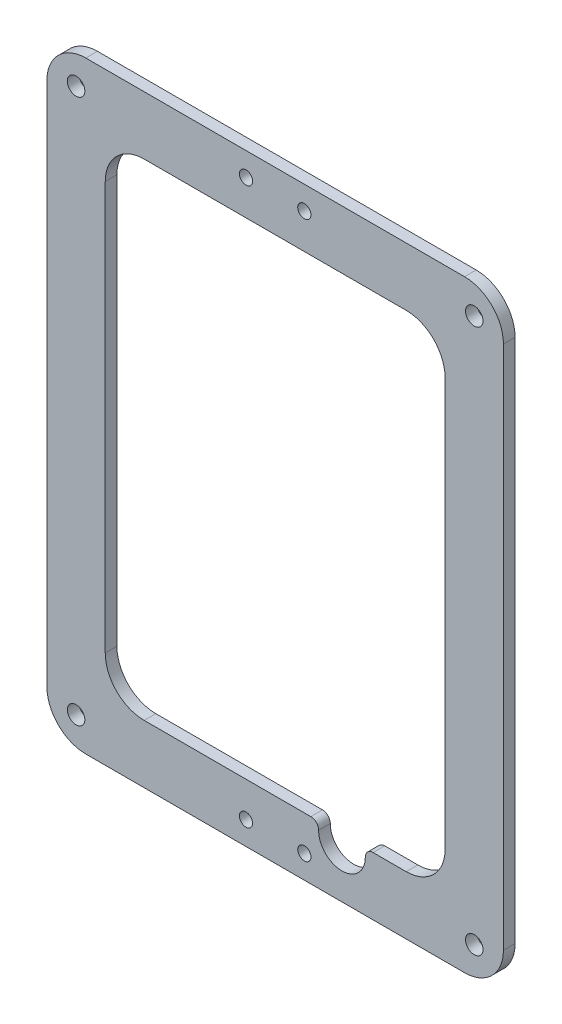
ISO-10303-21;
HEADER;
FILE_DESCRIPTION(('STEP AP214'),'2;1');
FILE_NAME('part.step','',(''),(''),'','','');
FILE_SCHEMA(('AUTOMOTIVE_DESIGN { 1 0 10303 214 1 1 1 1 }'));
ENDSEC;
DATA;
#1=APPLICATION_CONTEXT('core data for automotive mechanical design processes');
#2=APPLICATION_PROTOCOL_DEFINITION('international standard','automotive_design',2000,#1);
#3=PRODUCT_CONTEXT('',#1,'mechanical');
#4=PRODUCT('Part','Part','',(#3));
#5=PRODUCT_RELATED_PRODUCT_CATEGORY('part','',(#4));
#6=PRODUCT_DEFINITION_FORMATION('','',#4);
#7=PRODUCT_DEFINITION_CONTEXT('part definition',#1,'design');
#8=PRODUCT_DEFINITION('design','',#6,#7);
#9=PRODUCT_DEFINITION_SHAPE('','',#8);
#10=(LENGTH_UNIT() NAMED_UNIT(*) SI_UNIT(.MILLI.,.METRE.));
#11=(NAMED_UNIT(*) PLANE_ANGLE_UNIT() SI_UNIT($,.RADIAN.));
#12=(NAMED_UNIT(*) SI_UNIT($,.STERADIAN.) SOLID_ANGLE_UNIT());
#13=UNCERTAINTY_MEASURE_WITH_UNIT(LENGTH_MEASURE(1.E-05),#10,'distance_accuracy_value','');
#14=(GEOMETRIC_REPRESENTATION_CONTEXT(3) GLOBAL_UNCERTAINTY_ASSIGNED_CONTEXT((#13)) GLOBAL_UNIT_ASSIGNED_CONTEXT((#10,
#11,#12)) REPRESENTATION_CONTEXT('',''));
#15=CARTESIAN_POINT('',(0.,0.,0.));
#16=DIRECTION('',(0.,0.,1.));
#17=DIRECTION('',(1.,0.,0.));
#18=AXIS2_PLACEMENT_3D('',#15,#16,#17);
#19=CARTESIAN_POINT('',(58.6964815263287,0.,103.));
#20=DIRECTION('',(-1.,0.,0.));
#21=DIRECTION('',(0.,-1.,0.));
#22=AXIS2_PLACEMENT_3D('',#19,#20,#21);
#23=PLANE('',#22);
#24=DIRECTION('',(0.,1.,0.));
#25=VECTOR('',#24,1.);
#26=CARTESIAN_POINT('',(58.6964815263287,0.,100.));
#27=LINE('',#26,#25);
#28=CARTESIAN_POINT('',(58.6964815263287,-145.,100.));
#29=VERTEX_POINT('',#28);
#30=CARTESIAN_POINT('',(58.6964815263287,-9.99999999999999,100.));
#31=VERTEX_POINT('',#30);
#32=EDGE_CURVE('E266',#29,#31,#27,.T.);
#33=ORIENTED_EDGE('',*,*,#32,.T.);
#34=DIRECTION('',(0.,0.,-1.));
#35=VECTOR('',#34,1.);
#36=CARTESIAN_POINT('',(58.6964815263287,-9.99999999999999,103.));
#37=LINE('',#36,#35);
#38=CARTESIAN_POINT('',(58.6964815263287,-9.99999999999999,103.));
#39=VERTEX_POINT('',#38);
#40=EDGE_CURVE('E303',#39,#31,#37,.T.);
#41=ORIENTED_EDGE('',*,*,#40,.F.);
#42=DIRECTION('',(0.,1.,0.));
#43=VECTOR('',#42,1.);
#44=CARTESIAN_POINT('',(58.6964815263287,0.,103.));
#45=LINE('',#44,#43);
#46=CARTESIAN_POINT('',(58.6964815263287,-145.,103.));
#47=VERTEX_POINT('',#46);
#48=EDGE_CURVE('E222',#47,#39,#45,.T.);
#49=ORIENTED_EDGE('',*,*,#48,.F.);
#50=DIRECTION('',(0.,0.,-1.));
#51=VECTOR('',#50,1.);
#52=CARTESIAN_POINT('',(58.6964815263287,-145.,103.));
#53=LINE('',#52,#51);
#54=EDGE_CURVE('E188',#47,#29,#53,.T.);
#55=ORIENTED_EDGE('',*,*,#54,.T.);
#56=EDGE_LOOP('',(#33,#41,#49,#55));
#57=FACE_BOUND('',#56,.T.);
#58=ADVANCED_FACE('F39',(#57),#23,.F.);
#59=CARTESIAN_POINT('',(48.6964815263286,-9.99999999999999,103.));
#60=DIRECTION('',(0.,0.,-1.));
#61=DIRECTION('',(-1.,0.,0.));
#62=AXIS2_PLACEMENT_3D('',#59,#60,#61);
#63=CYLINDRICAL_SURFACE('',#62,10.);
#64=CARTESIAN_POINT('',(48.6964815263286,-9.99999999999999,100.));
#65=DIRECTION('',(0.,0.,1.));
#66=DIRECTION('',(1.,0.,0.));
#67=AXIS2_PLACEMENT_3D('',#64,#65,#66);
#68=CIRCLE('',#67,10.);
#69=CARTESIAN_POINT('',(48.6964815263286,0.,100.));
#70=VERTEX_POINT('',#69);
#71=EDGE_CURVE('E269',#31,#70,#68,.T.);
#72=ORIENTED_EDGE('',*,*,#71,.T.);
#73=DIRECTION('',(0.,0.,-1.));
#74=VECTOR('',#73,1.);
#75=CARTESIAN_POINT('',(48.6964815263286,0.,103.));
#76=LINE('',#75,#74);
#77=CARTESIAN_POINT('',(48.6964815263286,0.,103.));
#78=VERTEX_POINT('',#77);
#79=EDGE_CURVE('E300',#78,#70,#76,.T.);
#80=ORIENTED_EDGE('',*,*,#79,.F.);
#81=CARTESIAN_POINT('',(48.6964815263286,-9.99999999999999,103.));
#82=DIRECTION('',(0.,0.,1.));
#83=DIRECTION('',(1.,0.,0.));
#84=AXIS2_PLACEMENT_3D('',#81,#82,#83);
#85=CIRCLE('',#84,10.);
#86=EDGE_CURVE('E225',#39,#78,#85,.T.);
#87=ORIENTED_EDGE('',*,*,#86,.F.);
#88=ORIENTED_EDGE('',*,*,#40,.T.);
#89=EDGE_LOOP('',(#72,#80,#87,#88));
#90=FACE_BOUND('',#89,.T.);
#91=ADVANCED_FACE('F377',(#90),#63,.T.);
#92=CARTESIAN_POINT('',(0.,0.,103.));
#93=DIRECTION('',(0.,-1.,0.));
#94=DIRECTION('',(1.,0.,0.));
#95=AXIS2_PLACEMENT_3D('',#92,#93,#94);
#96=PLANE('',#95);
#97=DIRECTION('',(-1.,0.,0.));
#98=VECTOR('',#97,1.);
#99=CARTESIAN_POINT('',(0.,0.,100.));
#100=LINE('',#99,#98);
#101=CARTESIAN_POINT('',(-48.6964815263286,0.,100.));
#102=VERTEX_POINT('',#101);
#103=EDGE_CURVE('E271',#70,#102,#100,.T.);
#104=ORIENTED_EDGE('',*,*,#103,.T.);
#105=DIRECTION('',(0.,0.,-1.));
#106=VECTOR('',#105,1.);
#107=CARTESIAN_POINT('',(-48.6964815263286,0.,103.));
#108=LINE('',#107,#106);
#109=CARTESIAN_POINT('',(-48.6964815263286,0.,103.));
#110=VERTEX_POINT('',#109);
#111=EDGE_CURVE('E297',#110,#102,#108,.T.);
#112=ORIENTED_EDGE('',*,*,#111,.F.);
#113=DIRECTION('',(-1.,0.,0.));
#114=VECTOR('',#113,1.);
#115=CARTESIAN_POINT('',(0.,0.,103.));
#116=LINE('',#115,#114);
#117=EDGE_CURVE('E227',#78,#110,#116,.T.);
#118=ORIENTED_EDGE('',*,*,#117,.F.);
#119=ORIENTED_EDGE('',*,*,#79,.T.);
#120=EDGE_LOOP('',(#104,#112,#118,#119));
#121=FACE_BOUND('',#120,.T.);
#122=ADVANCED_FACE('F383',(#121),#96,.F.);
#123=CARTESIAN_POINT('',(-48.6964815263286,-10.,103.));
#124=DIRECTION('',(0.,0.,-1.));
#125=DIRECTION('',(-1.,0.,0.));
#126=AXIS2_PLACEMENT_3D('',#123,#124,#125);
#127=CYLINDRICAL_SURFACE('',#126,9.99999999999999);
#128=CARTESIAN_POINT('',(-48.6964815263286,-10.,100.));
#129=DIRECTION('',(0.,0.,1.));
#130=DIRECTION('',(1.,0.,0.));
#131=AXIS2_PLACEMENT_3D('',#128,#129,#130);
#132=CIRCLE('',#131,9.99999999999999);
#133=CARTESIAN_POINT('',(-58.6964815263286,-10.,100.));
#134=VERTEX_POINT('',#133);
#135=EDGE_CURVE('E273',#102,#134,#132,.T.);
#136=ORIENTED_EDGE('',*,*,#135,.T.);
#137=DIRECTION('',(0.,0.,-1.));
#138=VECTOR('',#137,1.);
#139=CARTESIAN_POINT('',(-58.6964815263286,-10.,103.));
#140=LINE('',#139,#138);
#141=CARTESIAN_POINT('',(-58.6964815263286,-10.,103.));
#142=VERTEX_POINT('',#141);
#143=EDGE_CURVE('E294',#142,#134,#140,.T.);
#144=ORIENTED_EDGE('',*,*,#143,.F.);
#145=CARTESIAN_POINT('',(-48.6964815263286,-10.,103.));
#146=DIRECTION('',(0.,0.,1.));
#147=DIRECTION('',(1.,0.,0.));
#148=AXIS2_PLACEMENT_3D('',#145,#146,#147);
#149=CIRCLE('',#148,9.99999999999999);
#150=EDGE_CURVE('E229',#110,#142,#149,.T.);
#151=ORIENTED_EDGE('',*,*,#150,.F.);
#152=ORIENTED_EDGE('',*,*,#111,.T.);
#153=EDGE_LOOP('',(#136,#144,#151,#152));
#154=FACE_BOUND('',#153,.T.);
#155=ADVANCED_FACE('F425',(#154),#127,.T.);
#156=CARTESIAN_POINT('',(-58.6964815263286,0.,103.));
#157=DIRECTION('',(1.,0.,0.));
#158=DIRECTION('',(0.,1.,0.));
#159=AXIS2_PLACEMENT_3D('',#156,#157,#158);
#160=PLANE('',#159);
#161=DIRECTION('',(0.,-1.,0.));
#162=VECTOR('',#161,1.);
#163=CARTESIAN_POINT('',(-58.6964815263286,0.,100.));
#164=LINE('',#163,#162);
#165=CARTESIAN_POINT('',(-58.6964815263286,-145.,100.));
#166=VERTEX_POINT('',#165);
#167=EDGE_CURVE('E275',#134,#166,#164,.T.);
#168=ORIENTED_EDGE('',*,*,#167,.T.);
#169=DIRECTION('',(0.,0.,-1.));
#170=VECTOR('',#169,1.);
#171=CARTESIAN_POINT('',(-58.6964815263286,-145.,103.));
#172=LINE('',#171,#170);
#173=CARTESIAN_POINT('',(-58.6964815263286,-145.,103.));
#174=VERTEX_POINT('',#173);
#175=EDGE_CURVE('E291',#174,#166,#172,.T.);
#176=ORIENTED_EDGE('',*,*,#175,.F.);
#177=DIRECTION('',(0.,-1.,0.));
#178=VECTOR('',#177,1.);
#179=CARTESIAN_POINT('',(-58.6964815263286,0.,103.));
#180=LINE('',#179,#178);
#181=EDGE_CURVE('E231',#142,#174,#180,.T.);
#182=ORIENTED_EDGE('',*,*,#181,.F.);
#183=ORIENTED_EDGE('',*,*,#143,.T.);
#184=EDGE_LOOP('',(#168,#176,#182,#183));
#185=FACE_BOUND('',#184,.T.);
#186=ADVANCED_FACE('F417',(#185),#160,.F.);
#187=CARTESIAN_POINT('',(-48.6964815263286,-145.,103.));
#188=DIRECTION('',(0.,0.,-1.));
#189=DIRECTION('',(-1.,0.,0.));
#190=AXIS2_PLACEMENT_3D('',#187,#188,#189);
#191=CYLINDRICAL_SURFACE('',#190,9.99999999999998);
#192=CARTESIAN_POINT('',(-48.6964815263286,-145.,100.));
#193=DIRECTION('',(0.,0.,1.));
#194=DIRECTION('',(1.,0.,0.));
#195=AXIS2_PLACEMENT_3D('',#192,#193,#194);
#196=CIRCLE('',#195,9.99999999999998);
#197=CARTESIAN_POINT('',(-48.6964815263286,-155.,100.));
#198=VERTEX_POINT('',#197);
#199=EDGE_CURVE('E277',#166,#198,#196,.T.);
#200=ORIENTED_EDGE('',*,*,#199,.T.);
#201=DIRECTION('',(0.,0.,-1.));
#202=VECTOR('',#201,1.);
#203=CARTESIAN_POINT('',(-48.6964815263286,-155.,103.));
#204=LINE('',#203,#202);
#205=CARTESIAN_POINT('',(-48.6964815263286,-155.,103.));
#206=VERTEX_POINT('',#205);
#207=EDGE_CURVE('E288',#206,#198,#204,.T.);
#208=ORIENTED_EDGE('',*,*,#207,.F.);
#209=CARTESIAN_POINT('',(-48.6964815263286,-145.,103.));
#210=DIRECTION('',(0.,0.,1.));
#211=DIRECTION('',(1.,0.,0.));
#212=AXIS2_PLACEMENT_3D('',#209,#210,#211);
#213=CIRCLE('',#212,9.99999999999998);
#214=EDGE_CURVE('E233',#174,#206,#213,.T.);
#215=ORIENTED_EDGE('',*,*,#214,.F.);
#216=ORIENTED_EDGE('',*,*,#175,.T.);
#217=EDGE_LOOP('',(#200,#208,#215,#216));
#218=FACE_BOUND('',#217,.T.);
#219=ADVANCED_FACE('F411',(#218),#191,.T.);
#220=CARTESIAN_POINT('',(0.,-155.,103.));
#221=DIRECTION('',(0.,1.,0.));
#222=DIRECTION('',(0.,0.,1.));
#223=AXIS2_PLACEMENT_3D('',#220,#221,#222);
#224=PLANE('',#223);
#225=DIRECTION('',(1.,0.,0.));
#226=VECTOR('',#225,1.);
#227=CARTESIAN_POINT('',(0.,-155.,100.));
#228=LINE('',#227,#226);
#229=CARTESIAN_POINT('',(48.6964815263286,-155.,100.));
#230=VERTEX_POINT('',#229);
#231=EDGE_CURVE('E279',#198,#230,#228,.T.);
#232=ORIENTED_EDGE('',*,*,#231,.T.);
#233=DIRECTION('',(0.,0.,-1.));
#234=VECTOR('',#233,1.);
#235=CARTESIAN_POINT('',(48.6964815263286,-155.,103.));
#236=LINE('',#235,#234);
#237=CARTESIAN_POINT('',(48.6964815263286,-155.,103.));
#238=VERTEX_POINT('',#237);
#239=EDGE_CURVE('E285',#238,#230,#236,.T.);
#240=ORIENTED_EDGE('',*,*,#239,.F.);
#241=DIRECTION('',(1.,0.,0.));
#242=VECTOR('',#241,1.);
#243=CARTESIAN_POINT('',(0.,-155.,103.));
#244=LINE('',#243,#242);
#245=EDGE_CURVE('E235',#206,#238,#244,.T.);
#246=ORIENTED_EDGE('',*,*,#245,.F.);
#247=ORIENTED_EDGE('',*,*,#207,.T.);
#248=EDGE_LOOP('',(#232,#240,#246,#247));
#249=FACE_BOUND('',#248,.T.);
#250=ADVANCED_FACE('F406',(#249),#224,.F.);
#251=CARTESIAN_POINT('',(17.175,-142.094693275293,103.));
#252=DIRECTION('',(0.,0.,-1.));
#253=DIRECTION('',(-1.,0.,0.));
#254=AXIS2_PLACEMENT_3D('',#251,#252,#253);
#255=CYLINDRICAL_SURFACE('',#254,6.);
#256=CARTESIAN_POINT('',(17.175,-142.094693275293,100.));
#257=DIRECTION('',(0.,0.,1.));
#258=DIRECTION('',(1.,0.,0.));
#259=AXIS2_PLACEMENT_3D('',#256,#257,#258);
#260=CIRCLE('',#259,6.);
#261=CARTESIAN_POINT('',(11.1754203342415,-142.023673318823,100.));
#262=VERTEX_POINT('',#261);
#263=CARTESIAN_POINT('',(23.1745796657585,-142.023673318823,100.));
#264=VERTEX_POINT('',#263);
#265=EDGE_CURVE('E240',#262,#264,#260,.T.);
#266=ORIENTED_EDGE('',*,*,#265,.F.);
#267=DIRECTION('',(0.,0.,-1.));
#268=VECTOR('',#267,1.);
#269=CARTESIAN_POINT('',(11.1754203342415,-142.023673318823,103.));
#270=LINE('',#269,#268);
#271=CARTESIAN_POINT('',(11.1754203342415,-142.023673318823,103.));
#272=VERTEX_POINT('',#271);
#273=EDGE_CURVE('E328',#262,#272,#270,.F.);
#274=ORIENTED_EDGE('',*,*,#273,.T.);
#275=CARTESIAN_POINT('',(17.175,-142.094693275293,103.));
#276=DIRECTION('',(0.,0.,1.));
#277=DIRECTION('',(1.,0.,0.));
#278=AXIS2_PLACEMENT_3D('',#275,#276,#277);
#279=CIRCLE('',#278,6.);
#280=CARTESIAN_POINT('',(23.1745796657585,-142.023673318823,103.));
#281=VERTEX_POINT('',#280);
#282=EDGE_CURVE('E198',#272,#281,#279,.T.);
#283=ORIENTED_EDGE('',*,*,#282,.T.);
#284=DIRECTION('',(0.,0.,-1.));
#285=VECTOR('',#284,1.);
#286=CARTESIAN_POINT('',(23.1745796657585,-142.023673318823,103.));
#287=LINE('',#286,#285);
#288=EDGE_CURVE('E325',#281,#264,#287,.T.);
#289=ORIENTED_EDGE('',*,*,#288,.T.);
#290=EDGE_LOOP('',(#266,#274,#283,#289));
#291=FACE_BOUND('',#290,.T.);
#292=ADVANCED_FACE('F333',(#291),#255,.F.);
#293=CARTESIAN_POINT('',(0.,-140.,103.));
#294=DIRECTION('',(0.,1.,0.));
#295=DIRECTION('',(0.,0.,1.));
#296=AXIS2_PLACEMENT_3D('',#293,#294,#295);
#297=PLANE('',#296);
#298=DIRECTION('',(1.,0.,0.));
#299=VECTOR('',#298,1.);
#300=CARTESIAN_POINT('',(0.,-140.,103.));
#301=LINE('',#300,#299);
#302=CARTESIAN_POINT('',(-33.6964815263286,-140.,103.));
#303=VERTEX_POINT('',#302);
#304=CARTESIAN_POINT('',(9.17556044565532,-140.,103.));
#305=VERTEX_POINT('',#304);
#306=EDGE_CURVE('E180',#303,#305,#301,.T.);
#307=ORIENTED_EDGE('',*,*,#306,.T.);
#308=DIRECTION('',(0.,0.,-1.));
#309=VECTOR('',#308,1.);
#310=CARTESIAN_POINT('',(9.17556044565532,-140.,103.));
#311=LINE('',#310,#309);
#312=CARTESIAN_POINT('',(9.17556044565532,-140.,100.));
#313=VERTEX_POINT('',#312);
#314=EDGE_CURVE('E306',#305,#313,#311,.T.);
#315=ORIENTED_EDGE('',*,*,#314,.T.);
#316=DIRECTION('',(1.,0.,0.));
#317=VECTOR('',#316,1.);
#318=CARTESIAN_POINT('',(0.,-140.,100.));
#319=LINE('',#318,#317);
#320=CARTESIAN_POINT('',(-33.6964815263286,-140.,100.));
#321=VERTEX_POINT('',#320);
#322=EDGE_CURVE('E183',#321,#313,#319,.T.);
#323=ORIENTED_EDGE('',*,*,#322,.F.);
#324=DIRECTION('',(0.,0.,-1.));
#325=VECTOR('',#324,1.);
#326=CARTESIAN_POINT('',(-33.6964815263286,-140.,103.));
#327=LINE('',#326,#325);
#328=EDGE_CURVE('E176',#303,#321,#327,.T.);
#329=ORIENTED_EDGE('',*,*,#328,.F.);
#330=EDGE_LOOP('',(#307,#315,#323,#329));
#331=FACE_BOUND('',#330,.T.);
#332=ADVANCED_FACE('F178',(#331),#297,.T.);
#333=CARTESIAN_POINT('',(-33.6964815263286,-130.,103.));
#334=DIRECTION('',(0.,0.,-1.));
#335=DIRECTION('',(-1.,0.,0.));
#336=AXIS2_PLACEMENT_3D('',#333,#334,#335);
#337=CYLINDRICAL_SURFACE('',#336,10.);
#338=CARTESIAN_POINT('',(-33.6964815263286,-130.,100.));
#339=DIRECTION('',(0.,0.,1.));
#340=DIRECTION('',(1.,0.,0.));
#341=AXIS2_PLACEMENT_3D('',#338,#339,#340);
#342=CIRCLE('',#341,10.);
#343=CARTESIAN_POINT('',(-43.6964815263286,-130.,100.));
#344=VERTEX_POINT('',#343);
#345=EDGE_CURVE('E245',#344,#321,#342,.T.);
#346=ORIENTED_EDGE('',*,*,#345,.F.);
#347=DIRECTION('',(0.,0.,-1.));
#348=VECTOR('',#347,1.);
#349=CARTESIAN_POINT('',(-43.6964815263286,-130.,103.));
#350=LINE('',#349,#348);
#351=CARTESIAN_POINT('',(-43.6964815263286,-130.,103.));
#352=VERTEX_POINT('',#351);
#353=EDGE_CURVE('E189',#352,#344,#350,.T.);
#354=ORIENTED_EDGE('',*,*,#353,.F.);
#355=CARTESIAN_POINT('',(-33.6964815263286,-130.,103.));
#356=DIRECTION('',(0.,0.,1.));
#357=DIRECTION('',(1.,0.,0.));
#358=AXIS2_PLACEMENT_3D('',#355,#356,#357);
#359=CIRCLE('',#358,10.);
#360=EDGE_CURVE('E195',#352,#303,#359,.T.);
#361=ORIENTED_EDGE('',*,*,#360,.T.);
#362=ORIENTED_EDGE('',*,*,#328,.T.);
#363=EDGE_LOOP('',(#346,#354,#361,#362));
#364=FACE_BOUND('',#363,.T.);
#365=ADVANCED_FACE('F201',(#364),#337,.F.);
#366=CARTESIAN_POINT('',(-43.6964815263286,0.,103.));
#367=DIRECTION('',(1.,0.,0.));
#368=DIRECTION('',(0.,1.,0.));
#369=AXIS2_PLACEMENT_3D('',#366,#367,#368);
#370=PLANE('',#369);
#371=DIRECTION('',(0.,-1.,0.));
#372=VECTOR('',#371,1.);
#373=CARTESIAN_POINT('',(-43.6964815263286,0.,100.));
#374=LINE('',#373,#372);
#375=CARTESIAN_POINT('',(-43.6964815263286,-25.,100.));
#376=VERTEX_POINT('',#375);
#377=EDGE_CURVE('E248',#376,#344,#374,.T.);
#378=ORIENTED_EDGE('',*,*,#377,.F.);
#379=DIRECTION('',(0.,0.,-1.));
#380=VECTOR('',#379,1.);
#381=CARTESIAN_POINT('',(-43.6964815263286,-25.,103.));
#382=LINE('',#381,#380);
#383=CARTESIAN_POINT('',(-43.6964815263286,-25.,103.));
#384=VERTEX_POINT('',#383);
#385=EDGE_CURVE('E317',#384,#376,#382,.T.);
#386=ORIENTED_EDGE('',*,*,#385,.F.);
#387=DIRECTION('',(0.,-1.,0.));
#388=VECTOR('',#387,1.);
#389=CARTESIAN_POINT('',(-43.6964815263286,0.,103.));
#390=LINE('',#389,#388);
#391=EDGE_CURVE('E202',#384,#352,#390,.T.);
#392=ORIENTED_EDGE('',*,*,#391,.T.);
#393=ORIENTED_EDGE('',*,*,#353,.T.);
#394=EDGE_LOOP('',(#378,#386,#392,#393));
#395=FACE_BOUND('',#394,.T.);
#396=ADVANCED_FACE('F343',(#395),#370,.T.);
#397=CARTESIAN_POINT('',(-33.6964815263286,-25.,103.));
#398=DIRECTION('',(0.,0.,-1.));
#399=DIRECTION('',(-1.,0.,0.));
#400=AXIS2_PLACEMENT_3D('',#397,#398,#399);
#401=CYLINDRICAL_SURFACE('',#400,10.);
#402=CARTESIAN_POINT('',(-33.6964815263286,-25.,100.));
#403=DIRECTION('',(0.,0.,1.));
#404=DIRECTION('',(1.,0.,0.));
#405=AXIS2_PLACEMENT_3D('',#402,#403,#404);
#406=CIRCLE('',#405,10.);
#407=CARTESIAN_POINT('',(-33.6964815263286,-15.,100.));
#408=VERTEX_POINT('',#407);
#409=EDGE_CURVE('E251',#408,#376,#406,.T.);
#410=ORIENTED_EDGE('',*,*,#409,.F.);
#411=DIRECTION('',(0.,0.,-1.));
#412=VECTOR('',#411,1.);
#413=CARTESIAN_POINT('',(-33.6964815263286,-15.,103.));
#414=LINE('',#413,#412);
#415=CARTESIAN_POINT('',(-33.6964815263286,-15.,103.));
#416=VERTEX_POINT('',#415);
#417=EDGE_CURVE('E315',#416,#408,#414,.T.);
#418=ORIENTED_EDGE('',*,*,#417,.F.);
#419=CARTESIAN_POINT('',(-33.6964815263286,-25.,103.));
#420=DIRECTION('',(0.,0.,1.));
#421=DIRECTION('',(1.,0.,0.));
#422=AXIS2_PLACEMENT_3D('',#419,#420,#421);
#423=CIRCLE('',#422,10.);
#424=EDGE_CURVE('E204',#416,#384,#423,.T.);
#425=ORIENTED_EDGE('',*,*,#424,.T.);
#426=ORIENTED_EDGE('',*,*,#385,.T.);
#427=EDGE_LOOP('',(#410,#418,#425,#426));
#428=FACE_BOUND('',#427,.T.);
#429=ADVANCED_FACE('F347',(#428),#401,.F.);
#430=CARTESIAN_POINT('',(0.,-15.,103.));
#431=DIRECTION('',(0.,-1.,0.));
#432=DIRECTION('',(1.,0.,0.));
#433=AXIS2_PLACEMENT_3D('',#430,#431,#432);
#434=PLANE('',#433);
#435=DIRECTION('',(-1.,0.,0.));
#436=VECTOR('',#435,1.);
#437=CARTESIAN_POINT('',(0.,-15.,100.));
#438=LINE('',#437,#436);
#439=CARTESIAN_POINT('',(33.6964815263287,-15.,100.));
#440=VERTEX_POINT('',#439);
#441=EDGE_CURVE('E254',#440,#408,#438,.T.);
#442=ORIENTED_EDGE('',*,*,#441,.F.);
#443=DIRECTION('',(0.,0.,-1.));
#444=VECTOR('',#443,1.);
#445=CARTESIAN_POINT('',(33.6964815263287,-15.,103.));
#446=LINE('',#445,#444);
#447=CARTESIAN_POINT('',(33.6964815263287,-15.,103.));
#448=VERTEX_POINT('',#447);
#449=EDGE_CURVE('E313',#448,#440,#446,.T.);
#450=ORIENTED_EDGE('',*,*,#449,.F.);
#451=DIRECTION('',(-1.,0.,0.));
#452=VECTOR('',#451,1.);
#453=CARTESIAN_POINT('',(0.,-15.,103.));
#454=LINE('',#453,#452);
#455=EDGE_CURVE('E210',#448,#416,#454,.T.);
#456=ORIENTED_EDGE('',*,*,#455,.T.);
#457=ORIENTED_EDGE('',*,*,#417,.T.);
#458=EDGE_LOOP('',(#442,#450,#456,#457));
#459=FACE_BOUND('',#458,.T.);
#460=ADVANCED_FACE('F350',(#459),#434,.T.);
#461=CARTESIAN_POINT('',(33.6964815263287,-25.,103.));
#462=DIRECTION('',(0.,0.,-1.));
#463=DIRECTION('',(-1.,0.,0.));
#464=AXIS2_PLACEMENT_3D('',#461,#462,#463);
#465=CYLINDRICAL_SURFACE('',#464,10.);
#466=CARTESIAN_POINT('',(33.6964815263287,-25.,100.));
#467=DIRECTION('',(0.,0.,1.));
#468=DIRECTION('',(1.,0.,0.));
#469=AXIS2_PLACEMENT_3D('',#466,#467,#468);
#470=CIRCLE('',#469,10.);
#471=CARTESIAN_POINT('',(43.6964815263287,-25.,100.));
#472=VERTEX_POINT('',#471);
#473=EDGE_CURVE('E257',#472,#440,#470,.T.);
#474=ORIENTED_EDGE('',*,*,#473,.F.);
#475=DIRECTION('',(0.,0.,-1.));
#476=VECTOR('',#475,1.);
#477=CARTESIAN_POINT('',(43.6964815263287,-25.,103.));
#478=LINE('',#477,#476);
#479=CARTESIAN_POINT('',(43.6964815263287,-25.,103.));
#480=VERTEX_POINT('',#479);
#481=EDGE_CURVE('E311',#480,#472,#478,.T.);
#482=ORIENTED_EDGE('',*,*,#481,.F.);
#483=CARTESIAN_POINT('',(33.6964815263287,-25.,103.));
#484=DIRECTION('',(0.,0.,1.));
#485=DIRECTION('',(1.,0.,0.));
#486=AXIS2_PLACEMENT_3D('',#483,#484,#485);
#487=CIRCLE('',#486,10.);
#488=EDGE_CURVE('E213',#480,#448,#487,.T.);
#489=ORIENTED_EDGE('',*,*,#488,.T.);
#490=ORIENTED_EDGE('',*,*,#449,.T.);
#491=EDGE_LOOP('',(#474,#482,#489,#490));
#492=FACE_BOUND('',#491,.T.);
#493=ADVANCED_FACE('F355',(#492),#465,.F.);
#494=CARTESIAN_POINT('',(43.6964815263287,0.,103.));
#495=DIRECTION('',(-1.,0.,0.));
#496=DIRECTION('',(0.,-1.,0.));
#497=AXIS2_PLACEMENT_3D('',#494,#495,#496);
#498=PLANE('',#497);
#499=DIRECTION('',(0.,1.,0.));
#500=VECTOR('',#499,1.);
#501=CARTESIAN_POINT('',(43.6964815263287,0.,100.));
#502=LINE('',#501,#500);
#503=CARTESIAN_POINT('',(43.6964815263287,-130.,100.));
#504=VERTEX_POINT('',#503);
#505=EDGE_CURVE('E260',#504,#472,#502,.T.);
#506=ORIENTED_EDGE('',*,*,#505,.F.);
#507=DIRECTION('',(0.,0.,-1.));
#508=VECTOR('',#507,1.);
#509=CARTESIAN_POINT('',(43.6964815263287,-130.,103.));
#510=LINE('',#509,#508);
#511=CARTESIAN_POINT('',(43.6964815263287,-130.,103.));
#512=VERTEX_POINT('',#511);
#513=EDGE_CURVE('E309',#512,#504,#510,.T.);
#514=ORIENTED_EDGE('',*,*,#513,.F.);
#515=DIRECTION('',(0.,1.,0.));
#516=VECTOR('',#515,1.);
#517=CARTESIAN_POINT('',(43.6964815263287,0.,103.));
#518=LINE('',#517,#516);
#519=EDGE_CURVE('E216',#512,#480,#518,.T.);
#520=ORIENTED_EDGE('',*,*,#519,.T.);
#521=ORIENTED_EDGE('',*,*,#481,.T.);
#522=EDGE_LOOP('',(#506,#514,#520,#521));
#523=FACE_BOUND('',#522,.T.);
#524=ADVANCED_FACE('F358',(#523),#498,.T.);
#525=CARTESIAN_POINT('',(33.6964815263287,-130.,103.));
#526=DIRECTION('',(0.,0.,-1.));
#527=DIRECTION('',(-1.,0.,0.));
#528=AXIS2_PLACEMENT_3D('',#525,#526,#527);
#529=CYLINDRICAL_SURFACE('',#528,10.);
#530=CARTESIAN_POINT('',(33.6964815263287,-130.,100.));
#531=DIRECTION('',(0.,0.,1.));
#532=DIRECTION('',(1.,0.,0.));
#533=AXIS2_PLACEMENT_3D('',#530,#531,#532);
#534=CIRCLE('',#533,10.);
#535=CARTESIAN_POINT('',(33.6964815263287,-140.,100.));
#536=VERTEX_POINT('',#535);
#537=EDGE_CURVE('E263',#536,#504,#534,.T.);
#538=ORIENTED_EDGE('',*,*,#537,.F.);
#539=DIRECTION('',(0.,0.,-1.));
#540=VECTOR('',#539,1.);
#541=CARTESIAN_POINT('',(33.6964815263287,-140.,103.));
#542=LINE('',#541,#540);
#543=CARTESIAN_POINT('',(33.6964815263287,-140.,103.));
#544=VERTEX_POINT('',#543);
#545=EDGE_CURVE('E239',#544,#536,#542,.T.);
#546=ORIENTED_EDGE('',*,*,#545,.F.);
#547=CARTESIAN_POINT('',(33.6964815263287,-130.,103.));
#548=DIRECTION('',(0.,0.,1.));
#549=DIRECTION('',(1.,0.,0.));
#550=AXIS2_PLACEMENT_3D('',#547,#548,#549);
#551=CIRCLE('',#550,10.);
#552=EDGE_CURVE('E219',#544,#512,#551,.T.);
#553=ORIENTED_EDGE('',*,*,#552,.T.);
#554=ORIENTED_EDGE('',*,*,#513,.T.);
#555=EDGE_LOOP('',(#538,#546,#553,#554));
#556=FACE_BOUND('',#555,.T.);
#557=ADVANCED_FACE('F363',(#556),#529,.F.);
#558=CARTESIAN_POINT('',(25.1744395543447,-140.,100.));
#559=VERTEX_POINT('',#558);
#560=EDGE_CURVE('E246',#559,#536,#319,.T.);
#561=ORIENTED_EDGE('',*,*,#560,.F.);
#562=DIRECTION('',(0.,0.,-1.));
#563=VECTOR('',#562,1.);
#564=CARTESIAN_POINT('',(25.1744395543447,-140.,103.));
#565=LINE('',#564,#563);
#566=CARTESIAN_POINT('',(25.1744395543447,-140.,103.));
#567=VERTEX_POINT('',#566);
#568=EDGE_CURVE('E11',#559,#567,#565,.F.);
#569=ORIENTED_EDGE('',*,*,#568,.T.);
#570=EDGE_CURVE('E200',#567,#544,#301,.T.);
#571=ORIENTED_EDGE('',*,*,#570,.T.);
#572=ORIENTED_EDGE('',*,*,#545,.T.);
#573=EDGE_LOOP('',(#561,#569,#571,#572));
#574=FACE_BOUND('',#573,.T.);
#575=ADVANCED_FACE('F364',(#574),#297,.T.);
#576=CARTESIAN_POINT('',(48.6964815263287,-145.,103.));
#577=DIRECTION('',(0.,0.,-1.));
#578=DIRECTION('',(-1.,0.,0.));
#579=AXIS2_PLACEMENT_3D('',#576,#577,#578);
#580=CYLINDRICAL_SURFACE('',#579,9.99999999999998);
#581=CARTESIAN_POINT('',(48.6964815263287,-145.,100.));
#582=DIRECTION('',(0.,0.,1.));
#583=DIRECTION('',(1.,0.,0.));
#584=AXIS2_PLACEMENT_3D('',#581,#582,#583);
#585=CIRCLE('',#584,9.99999999999998);
#586=EDGE_CURVE('E281',#230,#29,#585,.T.);
#587=ORIENTED_EDGE('',*,*,#586,.T.);
#588=ORIENTED_EDGE('',*,*,#54,.F.);
#589=CARTESIAN_POINT('',(48.6964815263287,-145.,103.));
#590=DIRECTION('',(0.,0.,1.));
#591=DIRECTION('',(1.,0.,0.));
#592=AXIS2_PLACEMENT_3D('',#589,#590,#591);
#593=CIRCLE('',#592,9.99999999999998);
#594=EDGE_CURVE('E237',#238,#47,#593,.T.);
#595=ORIENTED_EDGE('',*,*,#594,.F.);
#596=ORIENTED_EDGE('',*,*,#239,.T.);
#597=EDGE_LOOP('',(#587,#588,#595,#596));
#598=FACE_BOUND('',#597,.T.);
#599=ADVANCED_FACE('F390',(#598),#580,.T.);
#600=CARTESIAN_POINT('',(0.,0.,103.));
#601=DIRECTION('',(0.,0.,1.));
#602=DIRECTION('',(1.,0.,0.));
#603=AXIS2_PLACEMENT_3D('',#600,#601,#602);
#604=PLANE('',#603);
#605=CARTESIAN_POINT('',(-7.49999999999998,-6.,103.));
#606=DIRECTION('',(0.,0.,1.));
#607=DIRECTION('',(1.,0.,0.));
#608=AXIS2_PLACEMENT_3D('',#605,#606,#607);
#609=CIRCLE('',#608,1.69999999999999);
#610=CARTESIAN_POINT('',(-5.79999999999999,-6.,103.));
#611=VERTEX_POINT('',#610);
#612=EDGE_CURVE('E501',#611,#611,#609,.T.);
#613=ORIENTED_EDGE('',*,*,#612,.F.);
#614=EDGE_LOOP('',(#613));
#615=FACE_BOUND('',#614,.T.);
#616=CARTESIAN_POINT('',(7.49999999999998,-6.,103.));
#617=DIRECTION('',(0.,0.,1.));
#618=DIRECTION('',(1.,0.,0.));
#619=AXIS2_PLACEMENT_3D('',#616,#617,#618);
#620=CIRCLE('',#619,1.69999999999999);
#621=CARTESIAN_POINT('',(9.19999999999997,-6.,103.));
#622=VERTEX_POINT('',#621);
#623=EDGE_CURVE('E503',#622,#622,#620,.T.);
#624=ORIENTED_EDGE('',*,*,#623,.F.);
#625=EDGE_LOOP('',(#624));
#626=FACE_BOUND('',#625,.T.);
#627=CARTESIAN_POINT('',(-7.49999999999998,-149.,103.));
#628=DIRECTION('',(0.,0.,1.));
#629=DIRECTION('',(1.,0.,0.));
#630=AXIS2_PLACEMENT_3D('',#627,#628,#629);
#631=CIRCLE('',#630,1.69999999999999);
#632=CARTESIAN_POINT('',(-5.79999999999999,-149.,103.));
#633=VERTEX_POINT('',#632);
#634=EDGE_CURVE('E511',#633,#633,#631,.T.);
#635=ORIENTED_EDGE('',*,*,#634,.F.);
#636=EDGE_LOOP('',(#635));
#637=FACE_BOUND('',#636,.T.);
#638=CARTESIAN_POINT('',(7.50000000000002,-149.,103.));
#639=DIRECTION('',(0.,0.,1.));
#640=DIRECTION('',(1.,0.,0.));
#641=AXIS2_PLACEMENT_3D('',#638,#639,#640);
#642=CIRCLE('',#641,1.69999999999999);
#643=CARTESIAN_POINT('',(9.20000000000001,-149.,103.));
#644=VERTEX_POINT('',#643);
#645=EDGE_CURVE('E517',#644,#644,#642,.T.);
#646=ORIENTED_EDGE('',*,*,#645,.F.);
#647=EDGE_LOOP('',(#646));
#648=FACE_BOUND('',#647,.T.);
#649=CARTESIAN_POINT('',(-51.1964815263286,-7.50000000001012,103.));
#650=DIRECTION('',(0.,0.,1.));
#651=DIRECTION('',(1.,0.,0.));
#652=AXIS2_PLACEMENT_3D('',#649,#650,#651);
#653=CIRCLE('',#652,2.25);
#654=CARTESIAN_POINT('',(-48.9464815263286,-7.50000000001012,103.));
#655=VERTEX_POINT('',#654);
#656=EDGE_CURVE('E523',#655,#655,#653,.T.);
#657=ORIENTED_EDGE('',*,*,#656,.F.);
#658=EDGE_LOOP('',(#657));
#659=FACE_BOUND('',#658,.T.);
#660=CARTESIAN_POINT('',(51.1964815263286,-7.50000000001011,103.));
#661=DIRECTION('',(0.,0.,1.));
#662=DIRECTION('',(1.,0.,0.));
#663=AXIS2_PLACEMENT_3D('',#660,#661,#662);
#664=CIRCLE('',#663,2.25);
#665=CARTESIAN_POINT('',(53.4464815263286,-7.50000000001011,103.));
#666=VERTEX_POINT('',#665);
#667=EDGE_CURVE('E529',#666,#666,#664,.T.);
#668=ORIENTED_EDGE('',*,*,#667,.F.);
#669=EDGE_LOOP('',(#668));
#670=FACE_BOUND('',#669,.T.);
#671=CARTESIAN_POINT('',(51.1964815263286,-147.49999999999,103.));
#672=DIRECTION('',(0.,0.,1.));
#673=DIRECTION('',(1.,0.,0.));
#674=AXIS2_PLACEMENT_3D('',#671,#672,#673);
#675=CIRCLE('',#674,2.25);
#676=CARTESIAN_POINT('',(53.4464815263286,-147.49999999999,103.));
#677=VERTEX_POINT('',#676);
#678=EDGE_CURVE('E535',#677,#677,#675,.T.);
#679=ORIENTED_EDGE('',*,*,#678,.F.);
#680=EDGE_LOOP('',(#679));
#681=FACE_BOUND('',#680,.T.);
#682=CARTESIAN_POINT('',(-51.1964815263286,-147.49999999999,103.));
#683=DIRECTION('',(0.,0.,1.));
#684=DIRECTION('',(1.,0.,0.));
#685=AXIS2_PLACEMENT_3D('',#682,#683,#684);
#686=CIRCLE('',#685,2.25);
#687=CARTESIAN_POINT('',(-48.9464815263286,-147.49999999999,103.));
#688=VERTEX_POINT('',#687);
#689=EDGE_CURVE('E541',#688,#688,#686,.T.);
#690=ORIENTED_EDGE('',*,*,#689,.F.);
#691=EDGE_LOOP('',(#690));
#692=FACE_BOUND('',#691,.T.);
#693=ORIENTED_EDGE('',*,*,#282,.F.);
#694=CARTESIAN_POINT('',(9.17556044565532,-142.,103.));
#695=DIRECTION('',(0.,0.,1.));
#696=DIRECTION('',(1.,0.,0.));
#697=AXIS2_PLACEMENT_3D('',#694,#695,#696);
#698=CIRCLE('',#697,2.);
#699=EDGE_CURVE('E47',#272,#305,#698,.T.);
#700=ORIENTED_EDGE('',*,*,#699,.T.);
#701=ORIENTED_EDGE('',*,*,#306,.F.);
#702=ORIENTED_EDGE('',*,*,#360,.F.);
#703=ORIENTED_EDGE('',*,*,#391,.F.);
#704=ORIENTED_EDGE('',*,*,#424,.F.);
#705=ORIENTED_EDGE('',*,*,#455,.F.);
#706=ORIENTED_EDGE('',*,*,#488,.F.);
#707=ORIENTED_EDGE('',*,*,#519,.F.);
#708=ORIENTED_EDGE('',*,*,#552,.F.);
#709=ORIENTED_EDGE('',*,*,#570,.F.);
#710=CARTESIAN_POINT('',(25.1744395543447,-142.,103.));
#711=DIRECTION('',(0.,0.,1.));
#712=DIRECTION('',(1.,0.,0.));
#713=AXIS2_PLACEMENT_3D('',#710,#711,#712);
#714=CIRCLE('',#713,2.);
#715=EDGE_CURVE('E59',#567,#281,#714,.T.);
#716=ORIENTED_EDGE('',*,*,#715,.T.);
#717=EDGE_LOOP('',(#693,#700,#701,#702,#703,#704,#705,#706,#707,#708,#709,#716));
#718=FACE_BOUND('',#717,.T.);
#719=ORIENTED_EDGE('',*,*,#48,.T.);
#720=ORIENTED_EDGE('',*,*,#86,.T.);
#721=ORIENTED_EDGE('',*,*,#117,.T.);
#722=ORIENTED_EDGE('',*,*,#150,.T.);
#723=ORIENTED_EDGE('',*,*,#181,.T.);
#724=ORIENTED_EDGE('',*,*,#214,.T.);
#725=ORIENTED_EDGE('',*,*,#245,.T.);
#726=ORIENTED_EDGE('',*,*,#594,.T.);
#727=EDGE_LOOP('',(#719,#720,#721,#722,#723,#724,#725,#726));
#728=FACE_BOUND('',#727,.T.);
#729=ADVANCED_FACE('F192',(#615,#626,#637,#648,#659,#670,#681,#692,#718,#728),#604,.T.);
#730=CARTESIAN_POINT('',(0.,0.,100.));
#731=DIRECTION('',(0.,0.,1.));
#732=DIRECTION('',(1.,0.,0.));
#733=AXIS2_PLACEMENT_3D('',#730,#731,#732);
#734=PLANE('',#733);
#735=CARTESIAN_POINT('',(-7.49999999999998,-6.,100.));
#736=DIRECTION('',(0.,0.,1.));
#737=DIRECTION('',(1.,0.,0.));
#738=AXIS2_PLACEMENT_3D('',#735,#736,#737);
#739=CIRCLE('',#738,1.69999999999999);
#740=CARTESIAN_POINT('',(-5.79999999999999,-6.,100.));
#741=VERTEX_POINT('',#740);
#742=EDGE_CURVE('E499',#741,#741,#739,.T.);
#743=ORIENTED_EDGE('',*,*,#742,.T.);
#744=EDGE_LOOP('',(#743));
#745=FACE_BOUND('',#744,.T.);
#746=CARTESIAN_POINT('',(7.49999999999998,-6.,100.));
#747=DIRECTION('',(0.,0.,1.));
#748=DIRECTION('',(1.,0.,0.));
#749=AXIS2_PLACEMENT_3D('',#746,#747,#748);
#750=CIRCLE('',#749,1.69999999999999);
#751=CARTESIAN_POINT('',(9.19999999999997,-6.,100.));
#752=VERTEX_POINT('',#751);
#753=EDGE_CURVE('E508',#752,#752,#750,.T.);
#754=ORIENTED_EDGE('',*,*,#753,.T.);
#755=EDGE_LOOP('',(#754));
#756=FACE_BOUND('',#755,.T.);
#757=CARTESIAN_POINT('',(-7.49999999999998,-149.,100.));
#758=DIRECTION('',(0.,0.,1.));
#759=DIRECTION('',(1.,0.,0.));
#760=AXIS2_PLACEMENT_3D('',#757,#758,#759);
#761=CIRCLE('',#760,1.69999999999999);
#762=CARTESIAN_POINT('',(-5.79999999999999,-149.,100.));
#763=VERTEX_POINT('',#762);
#764=EDGE_CURVE('E514',#763,#763,#761,.T.);
#765=ORIENTED_EDGE('',*,*,#764,.T.);
#766=EDGE_LOOP('',(#765));
#767=FACE_BOUND('',#766,.T.);
#768=CARTESIAN_POINT('',(7.50000000000002,-149.,100.));
#769=DIRECTION('',(0.,0.,1.));
#770=DIRECTION('',(1.,0.,0.));
#771=AXIS2_PLACEMENT_3D('',#768,#769,#770);
#772=CIRCLE('',#771,1.69999999999999);
#773=CARTESIAN_POINT('',(9.20000000000001,-149.,100.));
#774=VERTEX_POINT('',#773);
#775=EDGE_CURVE('E520',#774,#774,#772,.T.);
#776=ORIENTED_EDGE('',*,*,#775,.T.);
#777=EDGE_LOOP('',(#776));
#778=FACE_BOUND('',#777,.T.);
#779=CARTESIAN_POINT('',(-51.1964815263286,-7.50000000001012,100.));
#780=DIRECTION('',(0.,0.,1.));
#781=DIRECTION('',(1.,0.,0.));
#782=AXIS2_PLACEMENT_3D('',#779,#780,#781);
#783=CIRCLE('',#782,2.25);
#784=CARTESIAN_POINT('',(-48.9464815263286,-7.50000000001012,100.));
#785=VERTEX_POINT('',#784);
#786=EDGE_CURVE('E526',#785,#785,#783,.T.);
#787=ORIENTED_EDGE('',*,*,#786,.T.);
#788=EDGE_LOOP('',(#787));
#789=FACE_BOUND('',#788,.T.);
#790=CARTESIAN_POINT('',(51.1964815263286,-7.50000000001011,100.));
#791=DIRECTION('',(0.,0.,1.));
#792=DIRECTION('',(1.,0.,0.));
#793=AXIS2_PLACEMENT_3D('',#790,#791,#792);
#794=CIRCLE('',#793,2.25);
#795=CARTESIAN_POINT('',(53.4464815263286,-7.50000000001011,100.));
#796=VERTEX_POINT('',#795);
#797=EDGE_CURVE('E532',#796,#796,#794,.T.);
#798=ORIENTED_EDGE('',*,*,#797,.T.);
#799=EDGE_LOOP('',(#798));
#800=FACE_BOUND('',#799,.T.);
#801=CARTESIAN_POINT('',(51.1964815263286,-147.49999999999,100.));
#802=DIRECTION('',(0.,0.,1.));
#803=DIRECTION('',(1.,0.,0.));
#804=AXIS2_PLACEMENT_3D('',#801,#802,#803);
#805=CIRCLE('',#804,2.25);
#806=CARTESIAN_POINT('',(53.4464815263286,-147.49999999999,100.));
#807=VERTEX_POINT('',#806);
#808=EDGE_CURVE('E538',#807,#807,#805,.T.);
#809=ORIENTED_EDGE('',*,*,#808,.T.);
#810=EDGE_LOOP('',(#809));
#811=FACE_BOUND('',#810,.T.);
#812=CARTESIAN_POINT('',(-51.1964815263286,-147.49999999999,100.));
#813=DIRECTION('',(0.,0.,1.));
#814=DIRECTION('',(1.,0.,0.));
#815=AXIS2_PLACEMENT_3D('',#812,#813,#814);
#816=CIRCLE('',#815,2.25);
#817=CARTESIAN_POINT('',(-48.9464815263286,-147.49999999999,100.));
#818=VERTEX_POINT('',#817);
#819=EDGE_CURVE('E243',#818,#818,#816,.T.);
#820=ORIENTED_EDGE('',*,*,#819,.T.);
#821=EDGE_LOOP('',(#820));
#822=FACE_BOUND('',#821,.T.);
#823=ORIENTED_EDGE('',*,*,#322,.T.);
#824=CARTESIAN_POINT('',(9.17556044565532,-142.,100.));
#825=DIRECTION('',(0.,0.,1.));
#826=DIRECTION('',(1.,0.,0.));
#827=AXIS2_PLACEMENT_3D('',#824,#825,#826);
#828=CIRCLE('',#827,2.);
#829=EDGE_CURVE('E323',#313,#262,#828,.F.);
#830=ORIENTED_EDGE('',*,*,#829,.T.);
#831=ORIENTED_EDGE('',*,*,#265,.T.);
#832=CARTESIAN_POINT('',(25.1744395543447,-142.,100.));
#833=DIRECTION('',(0.,0.,1.));
#834=DIRECTION('',(1.,0.,0.));
#835=AXIS2_PLACEMENT_3D('',#832,#833,#834);
#836=CIRCLE('',#835,2.);
#837=EDGE_CURVE('E321',#264,#559,#836,.F.);
#838=ORIENTED_EDGE('',*,*,#837,.T.);
#839=ORIENTED_EDGE('',*,*,#560,.T.);
#840=ORIENTED_EDGE('',*,*,#537,.T.);
#841=ORIENTED_EDGE('',*,*,#505,.T.);
#842=ORIENTED_EDGE('',*,*,#473,.T.);
#843=ORIENTED_EDGE('',*,*,#441,.T.);
#844=ORIENTED_EDGE('',*,*,#409,.T.);
#845=ORIENTED_EDGE('',*,*,#377,.T.);
#846=ORIENTED_EDGE('',*,*,#345,.T.);
#847=EDGE_LOOP('',(#823,#830,#831,#838,#839,#840,#841,#842,#843,#844,#845,#846));
#848=FACE_BOUND('',#847,.T.);
#849=ORIENTED_EDGE('',*,*,#32,.F.);
#850=ORIENTED_EDGE('',*,*,#586,.F.);
#851=ORIENTED_EDGE('',*,*,#231,.F.);
#852=ORIENTED_EDGE('',*,*,#199,.F.);
#853=ORIENTED_EDGE('',*,*,#167,.F.);
#854=ORIENTED_EDGE('',*,*,#135,.F.);
#855=ORIENTED_EDGE('',*,*,#103,.F.);
#856=ORIENTED_EDGE('',*,*,#71,.F.);
#857=EDGE_LOOP('',(#849,#850,#851,#852,#853,#854,#855,#856));
#858=FACE_BOUND('',#857,.T.);
#859=ADVANCED_FACE('F338',(#745,#756,#767,#778,#789,#800,#811,#822,#848,#858),#734,.F.);
#860=CARTESIAN_POINT('',(-51.1964815263286,-147.49999999999,103.));
#861=DIRECTION('',(0.,0.,1.));
#862=DIRECTION('',(1.,0.,0.));
#863=AXIS2_PLACEMENT_3D('',#860,#861,#862);
#864=CYLINDRICAL_SURFACE('',#863,2.25);
#865=ORIENTED_EDGE('',*,*,#819,.F.);
#866=EDGE_LOOP('',(#865));
#867=FACE_BOUND('',#866,.T.);
#868=ORIENTED_EDGE('',*,*,#689,.T.);
#869=EDGE_LOOP('',(#868));
#870=FACE_BOUND('',#869,.T.);
#871=ADVANCED_FACE('F465',(#867,#870),#864,.F.);
#872=CARTESIAN_POINT('',(51.1964815263286,-147.49999999999,103.));
#873=DIRECTION('',(0.,0.,1.));
#874=DIRECTION('',(1.,0.,0.));
#875=AXIS2_PLACEMENT_3D('',#872,#873,#874);
#876=CYLINDRICAL_SURFACE('',#875,2.25);
#877=ORIENTED_EDGE('',*,*,#808,.F.);
#878=EDGE_LOOP('',(#877));
#879=FACE_BOUND('',#878,.T.);
#880=ORIENTED_EDGE('',*,*,#678,.T.);
#881=EDGE_LOOP('',(#880));
#882=FACE_BOUND('',#881,.T.);
#883=ADVANCED_FACE('F472',(#879,#882),#876,.F.);
#884=CARTESIAN_POINT('',(51.1964815263286,-7.50000000001011,103.));
#885=DIRECTION('',(0.,0.,1.));
#886=DIRECTION('',(1.,0.,0.));
#887=AXIS2_PLACEMENT_3D('',#884,#885,#886);
#888=CYLINDRICAL_SURFACE('',#887,2.25);
#889=ORIENTED_EDGE('',*,*,#797,.F.);
#890=EDGE_LOOP('',(#889));
#891=FACE_BOUND('',#890,.T.);
#892=ORIENTED_EDGE('',*,*,#667,.T.);
#893=EDGE_LOOP('',(#892));
#894=FACE_BOUND('',#893,.T.);
#895=ADVANCED_FACE('F476',(#891,#894),#888,.F.);
#896=CARTESIAN_POINT('',(-51.1964815263286,-7.50000000001012,103.));
#897=DIRECTION('',(0.,0.,1.));
#898=DIRECTION('',(1.,0.,0.));
#899=AXIS2_PLACEMENT_3D('',#896,#897,#898);
#900=CYLINDRICAL_SURFACE('',#899,2.25);
#901=ORIENTED_EDGE('',*,*,#786,.F.);
#902=EDGE_LOOP('',(#901));
#903=FACE_BOUND('',#902,.T.);
#904=ORIENTED_EDGE('',*,*,#656,.T.);
#905=EDGE_LOOP('',(#904));
#906=FACE_BOUND('',#905,.T.);
#907=ADVANCED_FACE('F375',(#903,#906),#900,.F.);
#908=CARTESIAN_POINT('',(9.17556044565532,-142.,103.));
#909=DIRECTION('',(0.,0.,-1.));
#910=DIRECTION('',(-1.,0.,0.));
#911=AXIS2_PLACEMENT_3D('',#908,#909,#910);
#912=CYLINDRICAL_SURFACE('',#911,2.);
#913=ORIENTED_EDGE('',*,*,#699,.F.);
#914=ORIENTED_EDGE('',*,*,#273,.F.);
#915=ORIENTED_EDGE('',*,*,#829,.F.);
#916=ORIENTED_EDGE('',*,*,#314,.F.);
#917=EDGE_LOOP('',(#913,#914,#915,#916));
#918=FACE_BOUND('',#917,.T.);
#919=ADVANCED_FACE('F336',(#918),#912,.T.);
#920=CARTESIAN_POINT('',(25.1744395543447,-142.,103.));
#921=DIRECTION('',(0.,0.,-1.));
#922=DIRECTION('',(-1.,0.,0.));
#923=AXIS2_PLACEMENT_3D('',#920,#921,#922);
#924=CYLINDRICAL_SURFACE('',#923,2.);
#925=ORIENTED_EDGE('',*,*,#715,.F.);
#926=ORIENTED_EDGE('',*,*,#568,.F.);
#927=ORIENTED_EDGE('',*,*,#837,.F.);
#928=ORIENTED_EDGE('',*,*,#288,.F.);
#929=EDGE_LOOP('',(#925,#926,#927,#928));
#930=FACE_BOUND('',#929,.T.);
#931=ADVANCED_FACE('F41',(#930),#924,.T.);
#932=CARTESIAN_POINT('',(7.50000000000002,-149.,103.));
#933=DIRECTION('',(0.,0.,1.));
#934=DIRECTION('',(1.,0.,0.));
#935=AXIS2_PLACEMENT_3D('',#932,#933,#934);
#936=CYLINDRICAL_SURFACE('',#935,1.69999999999999);
#937=ORIENTED_EDGE('',*,*,#775,.F.);
#938=EDGE_LOOP('',(#937));
#939=FACE_BOUND('',#938,.T.);
#940=ORIENTED_EDGE('',*,*,#645,.T.);
#941=EDGE_LOOP('',(#940));
#942=FACE_BOUND('',#941,.T.);
#943=ADVANCED_FACE('F367',(#939,#942),#936,.F.);
#944=CARTESIAN_POINT('',(-7.49999999999998,-149.,103.));
#945=DIRECTION('',(0.,0.,1.));
#946=DIRECTION('',(1.,0.,0.));
#947=AXIS2_PLACEMENT_3D('',#944,#945,#946);
#948=CYLINDRICAL_SURFACE('',#947,1.69999999999999);
#949=ORIENTED_EDGE('',*,*,#764,.F.);
#950=EDGE_LOOP('',(#949));
#951=FACE_BOUND('',#950,.T.);
#952=ORIENTED_EDGE('',*,*,#634,.T.);
#953=EDGE_LOOP('',(#952));
#954=FACE_BOUND('',#953,.T.);
#955=ADVANCED_FACE('F372',(#951,#954),#948,.F.);
#956=CARTESIAN_POINT('',(7.49999999999998,-6.,103.));
#957=DIRECTION('',(0.,0.,1.));
#958=DIRECTION('',(1.,0.,0.));
#959=AXIS2_PLACEMENT_3D('',#956,#957,#958);
#960=CYLINDRICAL_SURFACE('',#959,1.69999999999999);
#961=ORIENTED_EDGE('',*,*,#753,.F.);
#962=EDGE_LOOP('',(#961));
#963=FACE_BOUND('',#962,.T.);
#964=ORIENTED_EDGE('',*,*,#623,.T.);
#965=EDGE_LOOP('',(#964));
#966=FACE_BOUND('',#965,.T.);
#967=ADVANCED_FACE('F486',(#963,#966),#960,.F.);
#968=CARTESIAN_POINT('',(-7.49999999999998,-6.,103.));
#969=DIRECTION('',(0.,0.,1.));
#970=DIRECTION('',(1.,0.,0.));
#971=AXIS2_PLACEMENT_3D('',#968,#969,#970);
#972=CYLINDRICAL_SURFACE('',#971,1.69999999999999);
#973=ORIENTED_EDGE('',*,*,#742,.F.);
#974=EDGE_LOOP('',(#973));
#975=FACE_BOUND('',#974,.T.);
#976=ORIENTED_EDGE('',*,*,#612,.T.);
#977=EDGE_LOOP('',(#976));
#978=FACE_BOUND('',#977,.T.);
#979=ADVANCED_FACE('F490',(#975,#978),#972,.F.);
#980=CLOSED_SHELL('',(#58,#91,#122,#155,#186,#219,#250,#292,#332,#365,#396,#429,#460,#493,#524,
#557,#575,#599,#729,#859,#871,#883,#895,#907,#919,#931,#943,#955,#967,#979));
#981=MANIFOLD_SOLID_BREP('B2',#980);
#982=ADVANCED_BREP_SHAPE_REPRESENTATION('',(#18,#981),#14);
#983=SHAPE_DEFINITION_REPRESENTATION(#9,#982);
ENDSEC;
END-ISO-10303-21;
